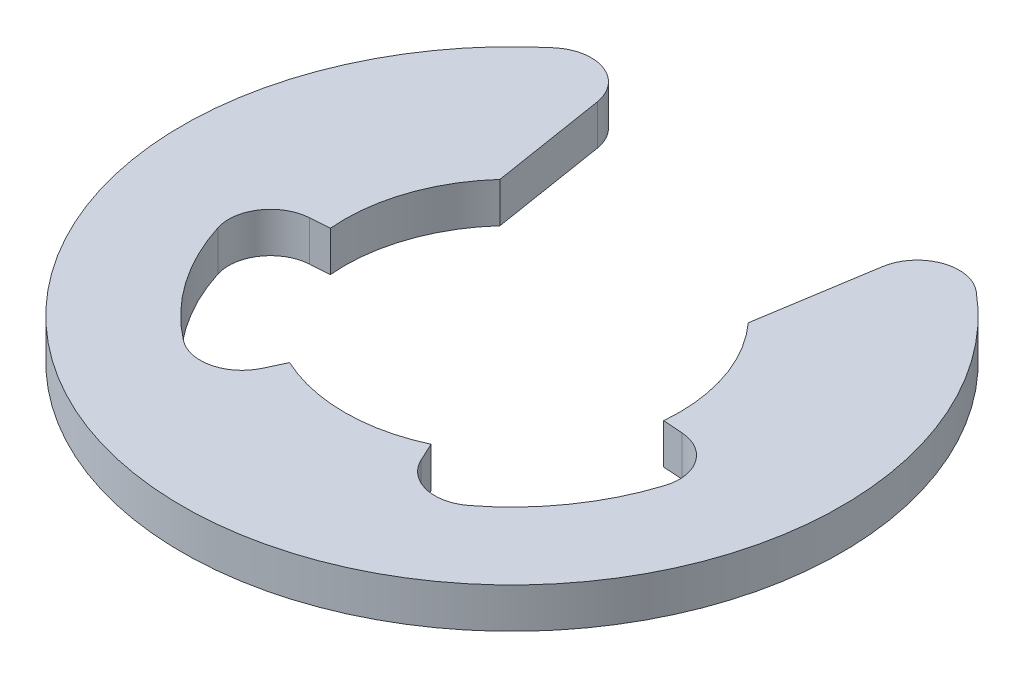
ISO-10303-21;
HEADER;
FILE_DESCRIPTION(('STEP AP214'),'2;1');
FILE_NAME('part.step','',(''),(''),'','','');
FILE_SCHEMA(('AUTOMOTIVE_DESIGN { 1 0 10303 214 1 1 1 1 }'));
ENDSEC;
DATA;
#1=APPLICATION_CONTEXT('core data for automotive mechanical design processes');
#2=APPLICATION_PROTOCOL_DEFINITION('international standard','automotive_design',2000,#1);
#3=PRODUCT_CONTEXT('',#1,'mechanical');
#4=PRODUCT('Part','Part','',(#3));
#5=PRODUCT_RELATED_PRODUCT_CATEGORY('part','',(#4));
#6=PRODUCT_DEFINITION_FORMATION('','',#4);
#7=PRODUCT_DEFINITION_CONTEXT('part definition',#1,'design');
#8=PRODUCT_DEFINITION('design','',#6,#7);
#9=PRODUCT_DEFINITION_SHAPE('','',#8);
#10=(LENGTH_UNIT() NAMED_UNIT(*) SI_UNIT(.MILLI.,.METRE.));
#11=(NAMED_UNIT(*) PLANE_ANGLE_UNIT() SI_UNIT($,.RADIAN.));
#12=(NAMED_UNIT(*) SI_UNIT($,.STERADIAN.) SOLID_ANGLE_UNIT());
#13=UNCERTAINTY_MEASURE_WITH_UNIT(LENGTH_MEASURE(1.E-05),#10,'distance_accuracy_value','');
#14=(GEOMETRIC_REPRESENTATION_CONTEXT(3) GLOBAL_UNCERTAINTY_ASSIGNED_CONTEXT((#13)) GLOBAL_UNIT_ASSIGNED_CONTEXT((#10,
#11,#12)) REPRESENTATION_CONTEXT('',''));
#15=CARTESIAN_POINT('',(0.,0.,0.));
#16=DIRECTION('',(0.,0.,1.));
#17=DIRECTION('',(1.,0.,0.));
#18=AXIS2_PLACEMENT_3D('',#15,#16,#17);
#19=CARTESIAN_POINT('',(3.50482384503729,1.2,4.55836701190877));
#20=DIRECTION('',(0.,-1.,0.));
#21=DIRECTION('',(0.,0.,1.));
#22=AXIS2_PLACEMENT_3D('',#19,#20,#21);
#23=CYLINDRICAL_SURFACE('',#22,1.24999999999999);
#24=CARTESIAN_POINT('',(3.50482384503729,0.,4.55836701190877));
#25=DIRECTION('',(0.,1.,0.));
#26=DIRECTION('',(0.,0.,1.));
#27=AXIS2_PLACEMENT_3D('',#24,#25,#26);
#28=CIRCLE('',#27,1.24999999999999);
#29=CARTESIAN_POINT('',(2.37193911124148,0.,5.08663983908464));
#30=VERTEX_POINT('',#29);
#31=CARTESIAN_POINT('',(4.2667420722193,0.,5.54931636232372));
#32=VERTEX_POINT('',#31);
#33=EDGE_CURVE('E190',#30,#32,#28,.T.);
#34=ORIENTED_EDGE('',*,*,#33,.F.);
#35=DIRECTION('',(0.,-1.,0.));
#36=VECTOR('',#35,1.);
#37=CARTESIAN_POINT('',(2.37193911124148,1.2,5.08663983908464));
#38=LINE('',#37,#36);
#39=CARTESIAN_POINT('',(2.37193911124148,1.2,5.08663983908464));
#40=VERTEX_POINT('',#39);
#41=EDGE_CURVE('E189',#40,#30,#38,.T.);
#42=ORIENTED_EDGE('',*,*,#41,.F.);
#43=CARTESIAN_POINT('',(3.50482384503729,1.2,4.55836701190877));
#44=DIRECTION('',(0.,1.,0.));
#45=DIRECTION('',(0.,0.,1.));
#46=AXIS2_PLACEMENT_3D('',#43,#44,#45);
#47=CIRCLE('',#46,1.24999999999999);
#48=CARTESIAN_POINT('',(4.2667420722193,1.2,5.54931636232372));
#49=VERTEX_POINT('',#48);
#50=EDGE_CURVE('E238',#40,#49,#47,.T.);
#51=ORIENTED_EDGE('',*,*,#50,.T.);
#52=DIRECTION('',(0.,-1.,0.));
#53=VECTOR('',#52,1.);
#54=CARTESIAN_POINT('',(4.2667420722193,1.2,5.54931636232372));
#55=LINE('',#54,#53);
#56=EDGE_CURVE('E11',#49,#32,#55,.T.);
#57=ORIENTED_EDGE('',*,*,#56,.T.);
#58=EDGE_LOOP('',(#34,#42,#51,#57));
#59=FACE_BOUND('',#58,.T.);
#60=ADVANCED_FACE('F34',(#59),#23,.F.);
#61=CARTESIAN_POINT('',(0.,1.2,0.));
#62=DIRECTION('',(0.,-1.,0.));
#63=DIRECTION('',(0.,0.,1.));
#64=AXIS2_PLACEMENT_3D('',#61,#62,#63);
#65=CYLINDRICAL_SURFACE('',#64,7.);
#66=CARTESIAN_POINT('',(0.,0.,0.));
#67=DIRECTION('',(0.,1.,0.));
#68=DIRECTION('',(0.,0.,-1.));
#69=AXIS2_PLACEMENT_3D('',#66,#67,#68);
#70=CIRCLE('',#69,7.);
#71=CARTESIAN_POINT('',(6.67396337115619,0.,2.11144806245986));
#72=VERTEX_POINT('',#71);
#73=EDGE_CURVE('E192',#32,#72,#70,.T.);
#74=ORIENTED_EDGE('',*,*,#73,.F.);
#75=ORIENTED_EDGE('',*,*,#56,.F.);
#76=CARTESIAN_POINT('',(0.,1.2,0.));
#77=DIRECTION('',(0.,1.,0.));
#78=DIRECTION('',(0.,0.,-1.));
#79=AXIS2_PLACEMENT_3D('',#76,#77,#78);
#80=CIRCLE('',#79,7.);
#81=CARTESIAN_POINT('',(6.67396337115619,1.2,2.11144806245986));
#82=VERTEX_POINT('',#81);
#83=EDGE_CURVE('E118',#49,#82,#80,.T.);
#84=ORIENTED_EDGE('',*,*,#83,.T.);
#85=DIRECTION('',(0.,-1.,0.));
#86=VECTOR('',#85,1.);
#87=CARTESIAN_POINT('',(6.67396337115619,1.2,2.11144806245986));
#88=LINE('',#87,#86);
#89=EDGE_CURVE('E42',#82,#72,#88,.T.);
#90=ORIENTED_EDGE('',*,*,#89,.T.);
#91=EDGE_LOOP('',(#74,#75,#84,#90));
#92=FACE_BOUND('',#91,.T.);
#93=ADVANCED_FACE('F280',(#92),#65,.F.);
#94=CARTESIAN_POINT('',(5.48218419773545,1.2,1.73440376559203));
#95=DIRECTION('',(0.,-1.,0.));
#96=DIRECTION('',(0.,0.,1.));
#97=AXIS2_PLACEMENT_3D('',#94,#95,#96);
#98=CYLINDRICAL_SURFACE('',#97,1.24999999999999);
#99=CARTESIAN_POINT('',(5.48218419773545,0.,1.73440376559203));
#100=DIRECTION('',(0.,1.,0.));
#101=DIRECTION('',(0.,0.,-1.));
#102=AXIS2_PLACEMENT_3D('',#99,#100,#101);
#103=CIRCLE('',#102,1.24999999999999);
#104=CARTESIAN_POINT('',(5.56808287520105,0.,0.487358691342648));
#105=VERTEX_POINT('',#104);
#106=EDGE_CURVE('E195',#72,#105,#103,.T.);
#107=ORIENTED_EDGE('',*,*,#106,.F.);
#108=ORIENTED_EDGE('',*,*,#89,.F.);
#109=CARTESIAN_POINT('',(5.48218419773545,1.2,1.73440376559203));
#110=DIRECTION('',(0.,1.,0.));
#111=DIRECTION('',(0.,0.,-1.));
#112=AXIS2_PLACEMENT_3D('',#109,#110,#111);
#113=CIRCLE('',#112,1.24999999999999);
#114=CARTESIAN_POINT('',(5.56808287520105,1.2,0.487358691342648));
#115=VERTEX_POINT('',#114);
#116=EDGE_CURVE('E289',#82,#115,#113,.T.);
#117=ORIENTED_EDGE('',*,*,#116,.T.);
#118=DIRECTION('',(0.,-1.,0.));
#119=VECTOR('',#118,1.);
#120=CARTESIAN_POINT('',(5.56808287520105,1.2,0.487358691342648));
#121=LINE('',#120,#119);
#122=EDGE_CURVE('E275',#115,#105,#121,.T.);
#123=ORIENTED_EDGE('',*,*,#122,.T.);
#124=EDGE_LOOP('',(#107,#108,#117,#123));
#125=FACE_BOUND('',#124,.T.);
#126=ADVANCED_FACE('F359',(#125),#98,.F.);
#127=CARTESIAN_POINT('',(4.97999247932663,1.2,0.446849981369804));
#128=DIRECTION('',(0.0687189419724793,0.,-0.99763605939951));
#129=DIRECTION('',(0.99763605939951,0.,0.0687189419724793));
#130=AXIS2_PLACEMENT_3D('',#127,#128,#129);
#131=PLANE('',#130);
#132=DIRECTION('',(-0.99763605939951,0.,-0.0687189419724793));
#133=VECTOR('',#132,1.);
#134=CARTESIAN_POINT('',(4.97999247932663,0.,0.446849981369804));
#135=LINE('',#134,#133);
#136=CARTESIAN_POINT('',(4.97999247932663,0.,0.446849981369804));
#137=VERTEX_POINT('',#136);
#138=EDGE_CURVE('E198',#105,#137,#135,.T.);
#139=ORIENTED_EDGE('',*,*,#138,.F.);
#140=ORIENTED_EDGE('',*,*,#122,.F.);
#141=DIRECTION('',(-0.99763605939951,0.,-0.0687189419724793));
#142=VECTOR('',#141,1.);
#143=CARTESIAN_POINT('',(4.97999247932663,1.2,0.446849981369804));
#144=LINE('',#143,#142);
#145=CARTESIAN_POINT('',(4.97999247932663,1.2,0.446849981369804));
#146=VERTEX_POINT('',#145);
#147=EDGE_CURVE('E293',#115,#146,#144,.T.);
#148=ORIENTED_EDGE('',*,*,#147,.T.);
#149=DIRECTION('',(0.,-1.,0.));
#150=VECTOR('',#149,1.);
#151=CARTESIAN_POINT('',(4.97999247932663,1.2,0.446849981369804));
#152=LINE('',#151,#150);
#153=EDGE_CURVE('E272',#146,#137,#152,.T.);
#154=ORIENTED_EDGE('',*,*,#153,.T.);
#155=EDGE_LOOP('',(#139,#140,#148,#154));
#156=FACE_BOUND('',#155,.T.);
#157=ADVANCED_FACE('F358',(#156),#131,.F.);
#158=CARTESIAN_POINT('',(0.,1.2,0.));
#159=DIRECTION('',(0.,-1.,0.));
#160=DIRECTION('',(0.,0.,1.));
#161=AXIS2_PLACEMENT_3D('',#158,#159,#160);
#162=CYLINDRICAL_SURFACE('',#161,5.);
#163=CARTESIAN_POINT('',(0.,0.,0.));
#164=DIRECTION('',(0.,1.,0.));
#165=DIRECTION('',(0.,0.,-1.));
#166=AXIS2_PLACEMENT_3D('',#163,#164,#165);
#167=CIRCLE('',#166,5.);
#168=CARTESIAN_POINT('',(3.71082851381224,0.,-3.35108217462331));
#169=VERTEX_POINT('',#168);
#170=EDGE_CURVE('E201',#137,#169,#167,.T.);
#171=ORIENTED_EDGE('',*,*,#170,.F.);
#172=ORIENTED_EDGE('',*,*,#153,.F.);
#173=CARTESIAN_POINT('',(0.,1.2,0.));
#174=DIRECTION('',(0.,1.,0.));
#175=DIRECTION('',(0.,0.,-1.));
#176=AXIS2_PLACEMENT_3D('',#173,#174,#175);
#177=CIRCLE('',#176,5.);
#178=CARTESIAN_POINT('',(3.71082851381224,1.2,-3.35108217462331));
#179=VERTEX_POINT('',#178);
#180=EDGE_CURVE('E296',#146,#179,#177,.T.);
#181=ORIENTED_EDGE('',*,*,#180,.T.);
#182=DIRECTION('',(0.,-1.,0.));
#183=VECTOR('',#182,1.);
#184=CARTESIAN_POINT('',(3.71082851381224,1.2,-3.35108217462331));
#185=LINE('',#184,#183);
#186=EDGE_CURVE('E269',#179,#169,#185,.T.);
#187=ORIENTED_EDGE('',*,*,#186,.T.);
#188=EDGE_LOOP('',(#171,#172,#181,#187));
#189=FACE_BOUND('',#188,.T.);
#190=ADVANCED_FACE('F356',(#189),#162,.F.);
#191=CARTESIAN_POINT('',(3.71082851381224,1.2,-3.35108217462331));
#192=DIRECTION('',(0.987539000514755,0.,0.157374465725288));
#193=DIRECTION('',(-0.157374465725288,0.,0.987539000514755));
#194=AXIS2_PLACEMENT_3D('',#191,#192,#193);
#195=PLANE('',#194);
#196=DIRECTION('',(0.157374465725288,0.,-0.987539000514754));
#197=VECTOR('',#196,1.);
#198=CARTESIAN_POINT('',(3.71082851381224,0.,-3.35108217462331));
#199=LINE('',#198,#197);
#200=CARTESIAN_POINT('',(4.26218467581493,0.,-6.8108919388213));
#201=VERTEX_POINT('',#200);
#202=EDGE_CURVE('E204',#169,#201,#199,.T.);
#203=ORIENTED_EDGE('',*,*,#202,.F.);
#204=ORIENTED_EDGE('',*,*,#186,.F.);
#205=DIRECTION('',(0.157374465725288,0.,-0.987539000514754));
#206=VECTOR('',#205,1.);
#207=CARTESIAN_POINT('',(3.71082851381224,1.2,-3.35108217462331));
#208=LINE('',#207,#206);
#209=CARTESIAN_POINT('',(4.26218467581493,1.2,-6.8108919388213));
#210=VERTEX_POINT('',#209);
#211=EDGE_CURVE('E299',#179,#210,#208,.T.);
#212=ORIENTED_EDGE('',*,*,#211,.T.);
#213=DIRECTION('',(0.,-1.,0.));
#214=VECTOR('',#213,1.);
#215=CARTESIAN_POINT('',(4.26218467581493,1.2,-6.8108919388213));
#216=LINE('',#215,#214);
#217=EDGE_CURVE('E266',#210,#201,#216,.T.);
#218=ORIENTED_EDGE('',*,*,#217,.T.);
#219=EDGE_LOOP('',(#203,#204,#212,#218));
#220=FACE_BOUND('',#219,.T.);
#221=ADVANCED_FACE('F352',(#220),#195,.F.);
#222=CARTESIAN_POINT('',(5.49660842645838,1.2,-6.61417385666469));
#223=DIRECTION('',(0.,-1.,0.));
#224=DIRECTION('',(0.,0.,1.));
#225=AXIS2_PLACEMENT_3D('',#222,#223,#224);
#226=CYLINDRICAL_SURFACE('',#225,1.25);
#227=CARTESIAN_POINT('',(5.49660842645838,0.,-6.61417385666469));
#228=DIRECTION('',(0.,-1.,0.));
#229=DIRECTION('',(0.,0.,-1.));
#230=AXIS2_PLACEMENT_3D('',#227,#228,#229);
#231=CIRCLE('',#230,1.25);
#232=CARTESIAN_POINT('',(6.29553406983896,0.,-7.57553633583107));
#233=VERTEX_POINT('',#232);
#234=EDGE_CURVE('E207',#201,#233,#231,.T.);
#235=ORIENTED_EDGE('',*,*,#234,.F.);
#236=ORIENTED_EDGE('',*,*,#217,.F.);
#237=CARTESIAN_POINT('',(5.49660842645838,1.2,-6.61417385666469));
#238=DIRECTION('',(0.,-1.,0.));
#239=DIRECTION('',(0.,0.,-1.));
#240=AXIS2_PLACEMENT_3D('',#237,#238,#239);
#241=CIRCLE('',#240,1.25);
#242=CARTESIAN_POINT('',(6.29553406983896,1.2,-7.57553633583107));
#243=VERTEX_POINT('',#242);
#244=EDGE_CURVE('E302',#210,#243,#241,.T.);
#245=ORIENTED_EDGE('',*,*,#244,.T.);
#246=DIRECTION('',(0.,-1.,0.));
#247=VECTOR('',#246,1.);
#248=CARTESIAN_POINT('',(6.29553406983896,1.2,-7.57553633583107));
#249=LINE('',#248,#247);
#250=EDGE_CURVE('E263',#243,#233,#249,.T.);
#251=ORIENTED_EDGE('',*,*,#250,.T.);
#252=EDGE_LOOP('',(#235,#236,#245,#251));
#253=FACE_BOUND('',#252,.T.);
#254=ADVANCED_FACE('F349',(#253),#226,.T.);
#255=CARTESIAN_POINT('',(0.,1.2,0.));
#256=DIRECTION('',(0.,-1.,0.));
#257=DIRECTION('',(0.,0.,1.));
#258=AXIS2_PLACEMENT_3D('',#255,#256,#257);
#259=CYLINDRICAL_SURFACE('',#258,9.85);
#260=CARTESIAN_POINT('',(0.,0.,0.));
#261=DIRECTION('',(0.,-1.,0.));
#262=DIRECTION('',(0.,0.,-1.));
#263=AXIS2_PLACEMENT_3D('',#260,#261,#262);
#264=CIRCLE('',#263,9.85);
#265=CARTESIAN_POINT('',(-6.29553406983896,0.,-7.57553633583108));
#266=VERTEX_POINT('',#265);
#267=EDGE_CURVE('E210',#233,#266,#264,.T.);
#268=ORIENTED_EDGE('',*,*,#267,.F.);
#269=ORIENTED_EDGE('',*,*,#250,.F.);
#270=CARTESIAN_POINT('',(0.,1.2,0.));
#271=DIRECTION('',(0.,-1.,0.));
#272=DIRECTION('',(0.,0.,-1.));
#273=AXIS2_PLACEMENT_3D('',#270,#271,#272);
#274=CIRCLE('',#273,9.85);
#275=CARTESIAN_POINT('',(-6.29553406983896,1.2,-7.57553633583108));
#276=VERTEX_POINT('',#275);
#277=EDGE_CURVE('E305',#243,#276,#274,.T.);
#278=ORIENTED_EDGE('',*,*,#277,.T.);
#279=DIRECTION('',(0.,-1.,0.));
#280=VECTOR('',#279,1.);
#281=CARTESIAN_POINT('',(-6.29553406983896,1.2,-7.57553633583108));
#282=LINE('',#281,#280);
#283=EDGE_CURVE('E260',#276,#266,#282,.T.);
#284=ORIENTED_EDGE('',*,*,#283,.T.);
#285=EDGE_LOOP('',(#268,#269,#278,#284));
#286=FACE_BOUND('',#285,.T.);
#287=ADVANCED_FACE('F347',(#286),#259,.T.);
#288=CARTESIAN_POINT('',(-5.49660842645838,1.2,-6.61417385666469));
#289=DIRECTION('',(0.,-1.,0.));
#290=DIRECTION('',(0.,0.,1.));
#291=AXIS2_PLACEMENT_3D('',#288,#289,#290);
#292=CYLINDRICAL_SURFACE('',#291,1.25);
#293=CARTESIAN_POINT('',(-5.49660842645838,0.,-6.61417385666469));
#294=DIRECTION('',(0.,-1.,0.));
#295=DIRECTION('',(0.,0.,1.));
#296=AXIS2_PLACEMENT_3D('',#293,#294,#295);
#297=CIRCLE('',#296,1.25);
#298=CARTESIAN_POINT('',(-4.26218467581493,0.,-6.8108919388213));
#299=VERTEX_POINT('',#298);
#300=EDGE_CURVE('E213',#266,#299,#297,.T.);
#301=ORIENTED_EDGE('',*,*,#300,.F.);
#302=ORIENTED_EDGE('',*,*,#283,.F.);
#303=CARTESIAN_POINT('',(-5.49660842645838,1.2,-6.61417385666469));
#304=DIRECTION('',(0.,-1.,0.));
#305=DIRECTION('',(0.,0.,1.));
#306=AXIS2_PLACEMENT_3D('',#303,#304,#305);
#307=CIRCLE('',#306,1.25);
#308=CARTESIAN_POINT('',(-4.26218467581493,1.2,-6.8108919388213));
#309=VERTEX_POINT('',#308);
#310=EDGE_CURVE('E308',#276,#309,#307,.T.);
#311=ORIENTED_EDGE('',*,*,#310,.T.);
#312=DIRECTION('',(0.,-1.,0.));
#313=VECTOR('',#312,1.);
#314=CARTESIAN_POINT('',(-4.26218467581493,1.2,-6.8108919388213));
#315=LINE('',#314,#313);
#316=EDGE_CURVE('E257',#309,#299,#315,.T.);
#317=ORIENTED_EDGE('',*,*,#316,.T.);
#318=EDGE_LOOP('',(#301,#302,#311,#317));
#319=FACE_BOUND('',#318,.T.);
#320=ADVANCED_FACE('F343',(#319),#292,.T.);
#321=CARTESIAN_POINT('',(-3.71082851381224,1.2,-3.35108217462331));
#322=DIRECTION('',(-0.987539000514755,0.,0.157374465725287));
#323=DIRECTION('',(-0.157374465725287,0.,-0.987539000514755));
#324=AXIS2_PLACEMENT_3D('',#321,#322,#323);
#325=PLANE('',#324);
#326=DIRECTION('',(0.157374465725287,0.,0.987539000514755));
#327=VECTOR('',#326,1.);
#328=CARTESIAN_POINT('',(-3.71082851381224,0.,-3.35108217462331));
#329=LINE('',#328,#327);
#330=CARTESIAN_POINT('',(-3.71082851381224,0.,-3.35108217462331));
#331=VERTEX_POINT('',#330);
#332=EDGE_CURVE('E216',#299,#331,#329,.T.);
#333=ORIENTED_EDGE('',*,*,#332,.F.);
#334=ORIENTED_EDGE('',*,*,#316,.F.);
#335=DIRECTION('',(0.157374465725287,0.,0.987539000514755));
#336=VECTOR('',#335,1.);
#337=CARTESIAN_POINT('',(-3.71082851381224,1.2,-3.35108217462331));
#338=LINE('',#337,#336);
#339=CARTESIAN_POINT('',(-3.71082851381224,1.2,-3.35108217462331));
#340=VERTEX_POINT('',#339);
#341=EDGE_CURVE('E311',#309,#340,#338,.T.);
#342=ORIENTED_EDGE('',*,*,#341,.T.);
#343=DIRECTION('',(0.,-1.,0.));
#344=VECTOR('',#343,1.);
#345=CARTESIAN_POINT('',(-3.71082851381224,1.2,-3.35108217462331));
#346=LINE('',#345,#344);
#347=EDGE_CURVE('E254',#340,#331,#346,.T.);
#348=ORIENTED_EDGE('',*,*,#347,.T.);
#349=EDGE_LOOP('',(#333,#334,#342,#348));
#350=FACE_BOUND('',#349,.T.);
#351=ADVANCED_FACE('F340',(#350),#325,.F.);
#352=CARTESIAN_POINT('',(0.,1.2,0.));
#353=DIRECTION('',(0.,-1.,0.));
#354=DIRECTION('',(0.,0.,1.));
#355=AXIS2_PLACEMENT_3D('',#352,#353,#354);
#356=CYLINDRICAL_SURFACE('',#355,5.);
#357=CARTESIAN_POINT('',(0.,0.,0.));
#358=DIRECTION('',(0.,1.,0.));
#359=DIRECTION('',(0.,0.,1.));
#360=AXIS2_PLACEMENT_3D('',#357,#358,#359);
#361=CIRCLE('',#360,5.);
#362=CARTESIAN_POINT('',(-4.97999247932663,0.,0.446849981369804));
#363=VERTEX_POINT('',#362);
#364=EDGE_CURVE('E219',#331,#363,#361,.T.);
#365=ORIENTED_EDGE('',*,*,#364,.F.);
#366=ORIENTED_EDGE('',*,*,#347,.F.);
#367=CARTESIAN_POINT('',(0.,1.2,0.));
#368=DIRECTION('',(0.,1.,0.));
#369=DIRECTION('',(0.,0.,1.));
#370=AXIS2_PLACEMENT_3D('',#367,#368,#369);
#371=CIRCLE('',#370,5.);
#372=CARTESIAN_POINT('',(-4.97999247932663,1.2,0.446849981369804));
#373=VERTEX_POINT('',#372);
#374=EDGE_CURVE('E314',#340,#373,#371,.T.);
#375=ORIENTED_EDGE('',*,*,#374,.T.);
#376=DIRECTION('',(0.,-1.,0.));
#377=VECTOR('',#376,1.);
#378=CARTESIAN_POINT('',(-4.97999247932663,1.2,0.446849981369804));
#379=LINE('',#378,#377);
#380=EDGE_CURVE('E251',#373,#363,#379,.T.);
#381=ORIENTED_EDGE('',*,*,#380,.T.);
#382=EDGE_LOOP('',(#365,#366,#375,#381));
#383=FACE_BOUND('',#382,.T.);
#384=ADVANCED_FACE('F338',(#383),#356,.F.);
#385=CARTESIAN_POINT('',(-4.97999247932663,1.2,0.446849981369804));
#386=DIRECTION('',(-0.0687189419724795,0.,-0.99763605939951));
#387=DIRECTION('',(0.99763605939951,0.,-0.0687189419724795));
#388=AXIS2_PLACEMENT_3D('',#385,#386,#387);
#389=PLANE('',#388);
#390=DIRECTION('',(-0.99763605939951,0.,0.0687189419724795));
#391=VECTOR('',#390,1.);
#392=CARTESIAN_POINT('',(-4.97999247932663,0.,0.446849981369804));
#393=LINE('',#392,#391);
#394=CARTESIAN_POINT('',(-5.56808287520105,0.,0.487358691342647));
#395=VERTEX_POINT('',#394);
#396=EDGE_CURVE('E222',#363,#395,#393,.T.);
#397=ORIENTED_EDGE('',*,*,#396,.F.);
#398=ORIENTED_EDGE('',*,*,#380,.F.);
#399=DIRECTION('',(-0.99763605939951,0.,0.0687189419724795));
#400=VECTOR('',#399,1.);
#401=CARTESIAN_POINT('',(-4.97999247932663,1.2,0.446849981369804));
#402=LINE('',#401,#400);
#403=CARTESIAN_POINT('',(-5.56808287520105,1.2,0.487358691342647));
#404=VERTEX_POINT('',#403);
#405=EDGE_CURVE('E317',#373,#404,#402,.T.);
#406=ORIENTED_EDGE('',*,*,#405,.T.);
#407=DIRECTION('',(0.,-1.,0.));
#408=VECTOR('',#407,1.);
#409=CARTESIAN_POINT('',(-5.56808287520105,1.2,0.487358691342647));
#410=LINE('',#409,#408);
#411=EDGE_CURVE('E248',#404,#395,#410,.T.);
#412=ORIENTED_EDGE('',*,*,#411,.T.);
#413=EDGE_LOOP('',(#397,#398,#406,#412));
#414=FACE_BOUND('',#413,.T.);
#415=ADVANCED_FACE('F334',(#414),#389,.F.);
#416=CARTESIAN_POINT('',(-5.48218419773545,1.2,1.73440376559203));
#417=DIRECTION('',(0.,-1.,0.));
#418=DIRECTION('',(0.,0.,1.));
#419=AXIS2_PLACEMENT_3D('',#416,#417,#418);
#420=CYLINDRICAL_SURFACE('',#419,1.25);
#421=CARTESIAN_POINT('',(-5.48218419773545,0.,1.73440376559203));
#422=DIRECTION('',(0.,1.,0.));
#423=DIRECTION('',(0.,0.,1.));
#424=AXIS2_PLACEMENT_3D('',#421,#422,#423);
#425=CIRCLE('',#424,1.25);
#426=CARTESIAN_POINT('',(-6.67396337115619,0.,2.11144806245986));
#427=VERTEX_POINT('',#426);
#428=EDGE_CURVE('E225',#395,#427,#425,.T.);
#429=ORIENTED_EDGE('',*,*,#428,.F.);
#430=ORIENTED_EDGE('',*,*,#411,.F.);
#431=CARTESIAN_POINT('',(-5.48218419773545,1.2,1.73440376559203));
#432=DIRECTION('',(0.,1.,0.));
#433=DIRECTION('',(0.,0.,1.));
#434=AXIS2_PLACEMENT_3D('',#431,#432,#433);
#435=CIRCLE('',#434,1.25);
#436=CARTESIAN_POINT('',(-6.67396337115619,1.2,2.11144806245986));
#437=VERTEX_POINT('',#436);
#438=EDGE_CURVE('E320',#404,#437,#435,.T.);
#439=ORIENTED_EDGE('',*,*,#438,.T.);
#440=DIRECTION('',(0.,-1.,0.));
#441=VECTOR('',#440,1.);
#442=CARTESIAN_POINT('',(-6.67396337115619,1.2,2.11144806245986));
#443=LINE('',#442,#441);
#444=EDGE_CURVE('E245',#437,#427,#443,.T.);
#445=ORIENTED_EDGE('',*,*,#444,.T.);
#446=EDGE_LOOP('',(#429,#430,#439,#445));
#447=FACE_BOUND('',#446,.T.);
#448=ADVANCED_FACE('F331',(#447),#420,.F.);
#449=CARTESIAN_POINT('',(0.,1.2,0.));
#450=DIRECTION('',(0.,-1.,0.));
#451=DIRECTION('',(0.,0.,1.));
#452=AXIS2_PLACEMENT_3D('',#449,#450,#451);
#453=CYLINDRICAL_SURFACE('',#452,7.);
#454=CARTESIAN_POINT('',(0.,0.,0.));
#455=DIRECTION('',(0.,1.,0.));
#456=DIRECTION('',(0.,0.,1.));
#457=AXIS2_PLACEMENT_3D('',#454,#455,#456);
#458=CIRCLE('',#457,7.);
#459=CARTESIAN_POINT('',(-4.2667420722193,0.,5.54931636232372));
#460=VERTEX_POINT('',#459);
#461=EDGE_CURVE('E228',#427,#460,#458,.T.);
#462=ORIENTED_EDGE('',*,*,#461,.F.);
#463=ORIENTED_EDGE('',*,*,#444,.F.);
#464=CARTESIAN_POINT('',(0.,1.2,0.));
#465=DIRECTION('',(0.,1.,0.));
#466=DIRECTION('',(0.,0.,1.));
#467=AXIS2_PLACEMENT_3D('',#464,#465,#466);
#468=CIRCLE('',#467,7.);
#469=CARTESIAN_POINT('',(-4.2667420722193,1.2,5.54931636232372));
#470=VERTEX_POINT('',#469);
#471=EDGE_CURVE('E184',#437,#470,#468,.T.);
#472=ORIENTED_EDGE('',*,*,#471,.T.);
#473=DIRECTION('',(0.,-1.,0.));
#474=VECTOR('',#473,1.);
#475=CARTESIAN_POINT('',(-4.2667420722193,1.2,5.54931636232372));
#476=LINE('',#475,#474);
#477=EDGE_CURVE('E242',#470,#460,#476,.T.);
#478=ORIENTED_EDGE('',*,*,#477,.T.);
#479=EDGE_LOOP('',(#462,#463,#472,#478));
#480=FACE_BOUND('',#479,.T.);
#481=ADVANCED_FACE('F325',(#480),#453,.F.);
#482=CARTESIAN_POINT('',(-3.50482384503729,1.2,4.55836701190877));
#483=DIRECTION('',(0.,-1.,0.));
#484=DIRECTION('',(0.,0.,1.));
#485=AXIS2_PLACEMENT_3D('',#482,#483,#484);
#486=CYLINDRICAL_SURFACE('',#485,1.24999999999999);
#487=CARTESIAN_POINT('',(-3.50482384503729,0.,4.55836701190877));
#488=DIRECTION('',(0.,1.,0.));
#489=DIRECTION('',(0.,0.,-1.));
#490=AXIS2_PLACEMENT_3D('',#487,#488,#489);
#491=CIRCLE('',#490,1.24999999999999);
#492=CARTESIAN_POINT('',(-2.37193911124148,0.,5.08663983908464));
#493=VERTEX_POINT('',#492);
#494=EDGE_CURVE('E231',#460,#493,#491,.T.);
#495=ORIENTED_EDGE('',*,*,#494,.F.);
#496=ORIENTED_EDGE('',*,*,#477,.F.);
#497=CARTESIAN_POINT('',(-3.50482384503729,1.2,4.55836701190877));
#498=DIRECTION('',(0.,1.,0.));
#499=DIRECTION('',(0.,0.,-1.));
#500=AXIS2_PLACEMENT_3D('',#497,#498,#499);
#501=CIRCLE('',#500,1.24999999999999);
#502=CARTESIAN_POINT('',(-2.37193911124148,1.2,5.08663983908464));
#503=VERTEX_POINT('',#502);
#504=EDGE_CURVE('E182',#470,#503,#501,.T.);
#505=ORIENTED_EDGE('',*,*,#504,.T.);
#506=DIRECTION('',(0.,-1.,0.));
#507=VECTOR('',#506,1.);
#508=CARTESIAN_POINT('',(-2.37193911124148,1.2,5.08663983908464));
#509=LINE('',#508,#507);
#510=EDGE_CURVE('E176',#503,#493,#509,.T.);
#511=ORIENTED_EDGE('',*,*,#510,.T.);
#512=EDGE_LOOP('',(#495,#496,#505,#511));
#513=FACE_BOUND('',#512,.T.);
#514=ADVANCED_FACE('F329',(#513),#486,.F.);
#515=CARTESIAN_POINT('',(-2.1130913087035,1.2,4.53153893518325));
#516=DIRECTION('',(0.90630778703665,0.,0.422618261740699));
#517=DIRECTION('',(-0.422618261740699,0.,0.90630778703665));
#518=AXIS2_PLACEMENT_3D('',#515,#516,#517);
#519=PLANE('',#518);
#520=DIRECTION('',(0.422618261740699,0.,-0.90630778703665));
#521=VECTOR('',#520,1.);
#522=CARTESIAN_POINT('',(-2.1130913087035,0.,4.53153893518325));
#523=LINE('',#522,#521);
#524=CARTESIAN_POINT('',(-2.1130913087035,0.,4.53153893518325));
#525=VERTEX_POINT('',#524);
#526=EDGE_CURVE('E234',#493,#525,#523,.T.);
#527=ORIENTED_EDGE('',*,*,#526,.F.);
#528=ORIENTED_EDGE('',*,*,#510,.F.);
#529=DIRECTION('',(0.422618261740699,0.,-0.90630778703665));
#530=VECTOR('',#529,1.);
#531=CARTESIAN_POINT('',(-2.1130913087035,1.2,4.53153893518325));
#532=LINE('',#531,#530);
#533=CARTESIAN_POINT('',(-2.1130913087035,1.2,4.53153893518325));
#534=VERTEX_POINT('',#533);
#535=EDGE_CURVE('E166',#503,#534,#532,.T.);
#536=ORIENTED_EDGE('',*,*,#535,.T.);
#537=DIRECTION('',(0.,-1.,0.));
#538=VECTOR('',#537,1.);
#539=CARTESIAN_POINT('',(-2.1130913087035,1.2,4.53153893518325));
#540=LINE('',#539,#538);
#541=EDGE_CURVE('E171',#534,#525,#540,.T.);
#542=ORIENTED_EDGE('',*,*,#541,.T.);
#543=EDGE_LOOP('',(#527,#528,#536,#542));
#544=FACE_BOUND('',#543,.T.);
#545=ADVANCED_FACE('F179',(#544),#519,.F.);
#546=CARTESIAN_POINT('',(0.,1.2,0.));
#547=DIRECTION('',(0.,-1.,0.));
#548=DIRECTION('',(0.,0.,1.));
#549=AXIS2_PLACEMENT_3D('',#546,#547,#548);
#550=CYLINDRICAL_SURFACE('',#549,5.);
#551=CARTESIAN_POINT('',(0.,0.,0.));
#552=DIRECTION('',(0.,1.,0.));
#553=DIRECTION('',(0.,0.,-1.));
#554=AXIS2_PLACEMENT_3D('',#551,#552,#553);
#555=CIRCLE('',#554,5.);
#556=CARTESIAN_POINT('',(2.1130913087035,0.,4.53153893518325));
#557=VERTEX_POINT('',#556);
#558=EDGE_CURVE('E173',#525,#557,#555,.T.);
#559=ORIENTED_EDGE('',*,*,#558,.F.);
#560=ORIENTED_EDGE('',*,*,#541,.F.);
#561=CARTESIAN_POINT('',(0.,1.2,0.));
#562=DIRECTION('',(0.,1.,0.));
#563=DIRECTION('',(0.,0.,-1.));
#564=AXIS2_PLACEMENT_3D('',#561,#562,#563);
#565=CIRCLE('',#564,5.);
#566=CARTESIAN_POINT('',(2.1130913087035,1.2,4.53153893518325));
#567=VERTEX_POINT('',#566);
#568=EDGE_CURVE('E162',#534,#567,#565,.T.);
#569=ORIENTED_EDGE('',*,*,#568,.T.);
#570=DIRECTION('',(0.,-1.,0.));
#571=VECTOR('',#570,1.);
#572=CARTESIAN_POINT('',(2.1130913087035,1.2,4.53153893518325));
#573=LINE('',#572,#571);
#574=EDGE_CURVE('E177',#567,#557,#573,.T.);
#575=ORIENTED_EDGE('',*,*,#574,.T.);
#576=EDGE_LOOP('',(#559,#560,#569,#575));
#577=FACE_BOUND('',#576,.T.);
#578=ADVANCED_FACE('F172',(#577),#550,.F.);
#579=CARTESIAN_POINT('',(2.1130913087035,1.2,4.53153893518325));
#580=DIRECTION('',(-0.90630778703665,0.,0.422618261740699));
#581=DIRECTION('',(-0.422618261740699,0.,-0.90630778703665));
#582=AXIS2_PLACEMENT_3D('',#579,#580,#581);
#583=PLANE('',#582);
#584=DIRECTION('',(0.422618261740699,0.,0.90630778703665));
#585=VECTOR('',#584,1.);
#586=CARTESIAN_POINT('',(2.1130913087035,0.,4.53153893518325));
#587=LINE('',#586,#585);
#588=EDGE_CURVE('E106',#557,#30,#587,.T.);
#589=ORIENTED_EDGE('',*,*,#588,.F.);
#590=ORIENTED_EDGE('',*,*,#574,.F.);
#591=DIRECTION('',(0.422618261740699,0.,0.90630778703665));
#592=VECTOR('',#591,1.);
#593=CARTESIAN_POINT('',(2.1130913087035,1.2,4.53153893518325));
#594=LINE('',#593,#592);
#595=EDGE_CURVE('E50',#567,#40,#594,.T.);
#596=ORIENTED_EDGE('',*,*,#595,.T.);
#597=ORIENTED_EDGE('',*,*,#41,.T.);
#598=EDGE_LOOP('',(#589,#590,#596,#597));
#599=FACE_BOUND('',#598,.T.);
#600=ADVANCED_FACE('F489',(#599),#583,.F.);
#601=CARTESIAN_POINT('',(3.50482384503729,1.2,4.55836701190877));
#602=DIRECTION('',(0.,-1.,0.));
#603=DIRECTION('',(0.,0.,1.));
#604=AXIS2_PLACEMENT_3D('',#601,#602,#603);
#605=PLANE('',#604);
#606=ORIENTED_EDGE('',*,*,#50,.F.);
#607=ORIENTED_EDGE('',*,*,#595,.F.);
#608=ORIENTED_EDGE('',*,*,#568,.F.);
#609=ORIENTED_EDGE('',*,*,#535,.F.);
#610=ORIENTED_EDGE('',*,*,#504,.F.);
#611=ORIENTED_EDGE('',*,*,#471,.F.);
#612=ORIENTED_EDGE('',*,*,#438,.F.);
#613=ORIENTED_EDGE('',*,*,#405,.F.);
#614=ORIENTED_EDGE('',*,*,#374,.F.);
#615=ORIENTED_EDGE('',*,*,#341,.F.);
#616=ORIENTED_EDGE('',*,*,#310,.F.);
#617=ORIENTED_EDGE('',*,*,#277,.F.);
#618=ORIENTED_EDGE('',*,*,#244,.F.);
#619=ORIENTED_EDGE('',*,*,#211,.F.);
#620=ORIENTED_EDGE('',*,*,#180,.F.);
#621=ORIENTED_EDGE('',*,*,#147,.F.);
#622=ORIENTED_EDGE('',*,*,#116,.F.);
#623=ORIENTED_EDGE('',*,*,#83,.F.);
#624=EDGE_LOOP('',(#606,#607,#608,#609,#610,#611,#612,#613,#614,#615,#616,#617,#618,#619,#620,
#621,#622,#623));
#625=FACE_BOUND('',#624,.T.);
#626=ADVANCED_FACE('F164',(#625),#605,.F.);
#627=CARTESIAN_POINT('',(3.50482384503729,0.,4.55836701190877));
#628=DIRECTION('',(0.,-1.,0.));
#629=DIRECTION('',(0.,0.,1.));
#630=AXIS2_PLACEMENT_3D('',#627,#628,#629);
#631=PLANE('',#630);
#632=ORIENTED_EDGE('',*,*,#33,.T.);
#633=ORIENTED_EDGE('',*,*,#73,.T.);
#634=ORIENTED_EDGE('',*,*,#106,.T.);
#635=ORIENTED_EDGE('',*,*,#138,.T.);
#636=ORIENTED_EDGE('',*,*,#170,.T.);
#637=ORIENTED_EDGE('',*,*,#202,.T.);
#638=ORIENTED_EDGE('',*,*,#234,.T.);
#639=ORIENTED_EDGE('',*,*,#267,.T.);
#640=ORIENTED_EDGE('',*,*,#300,.T.);
#641=ORIENTED_EDGE('',*,*,#332,.T.);
#642=ORIENTED_EDGE('',*,*,#364,.T.);
#643=ORIENTED_EDGE('',*,*,#396,.T.);
#644=ORIENTED_EDGE('',*,*,#428,.T.);
#645=ORIENTED_EDGE('',*,*,#461,.T.);
#646=ORIENTED_EDGE('',*,*,#494,.T.);
#647=ORIENTED_EDGE('',*,*,#526,.T.);
#648=ORIENTED_EDGE('',*,*,#558,.T.);
#649=ORIENTED_EDGE('',*,*,#588,.T.);
#650=EDGE_LOOP('',(#632,#633,#634,#635,#636,#637,#638,#639,#640,#641,#642,#643,#644,#645,#646,
#647,#648,#649));
#651=FACE_BOUND('',#650,.T.);
#652=ADVANCED_FACE('F283',(#651),#631,.T.);
#653=CLOSED_SHELL('',(#60,#93,#126,#157,#190,#221,#254,#287,#320,#351,#384,#415,#448,#481,#514,
#545,#578,#600,#626,#652));
#654=MANIFOLD_SOLID_BREP('B2',#653);
#655=ADVANCED_BREP_SHAPE_REPRESENTATION('',(#18,#654),#14);
#656=SHAPE_DEFINITION_REPRESENTATION(#9,#655);
ENDSEC;
END-ISO-10303-21;
